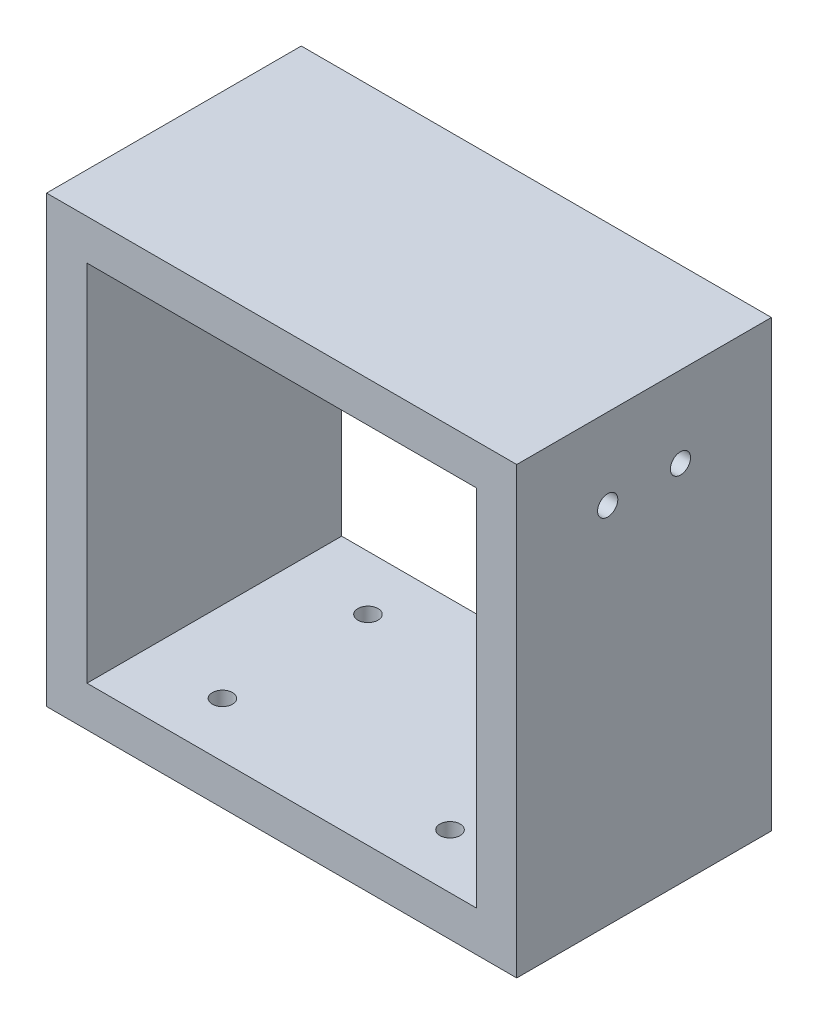
ISO-10303-21;
HEADER;
FILE_DESCRIPTION(('STEP AP214'),'2;1');
FILE_NAME('part.step','',(''),(''),'','','');
FILE_SCHEMA(('AUTOMOTIVE_DESIGN { 1 0 10303 214 1 1 1 1 }'));
ENDSEC;
DATA;
#1=APPLICATION_CONTEXT('core data for automotive mechanical design processes');
#2=APPLICATION_PROTOCOL_DEFINITION('international standard','automotive_design',2000,#1);
#3=PRODUCT_CONTEXT('',#1,'mechanical');
#4=PRODUCT('Part','Part','',(#3));
#5=PRODUCT_RELATED_PRODUCT_CATEGORY('part','',(#4));
#6=PRODUCT_DEFINITION_FORMATION('','',#4);
#7=PRODUCT_DEFINITION_CONTEXT('part definition',#1,'design');
#8=PRODUCT_DEFINITION('design','',#6,#7);
#9=PRODUCT_DEFINITION_SHAPE('','',#8);
#10=(LENGTH_UNIT() NAMED_UNIT(*) SI_UNIT(.MILLI.,.METRE.));
#11=(NAMED_UNIT(*) PLANE_ANGLE_UNIT() SI_UNIT($,.RADIAN.));
#12=(NAMED_UNIT(*) SI_UNIT($,.STERADIAN.) SOLID_ANGLE_UNIT());
#13=UNCERTAINTY_MEASURE_WITH_UNIT(LENGTH_MEASURE(1.E-05),#10,'distance_accuracy_value','');
#14=(GEOMETRIC_REPRESENTATION_CONTEXT(3) GLOBAL_UNCERTAINTY_ASSIGNED_CONTEXT((#13)) GLOBAL_UNIT_ASSIGNED_CONTEXT((#10,
#11,#12)) REPRESENTATION_CONTEXT('',''));
#15=CARTESIAN_POINT('',(0.,0.,0.));
#16=DIRECTION('',(0.,0.,1.));
#17=DIRECTION('',(1.,0.,0.));
#18=AXIS2_PLACEMENT_3D('',#15,#16,#17);
#19=CARTESIAN_POINT('',(0.,-55.,0.));
#20=DIRECTION('',(-1.,0.,0.));
#21=DIRECTION('',(0.,0.,1.));
#22=AXIS2_PLACEMENT_3D('',#19,#20,#21);
#23=PLANE('',#22);
#24=CARTESIAN_POINT('',(0.,-9.99999999999994,-11.25));
#25=DIRECTION('',(-1.,0.,0.));
#26=DIRECTION('',(0.,0.,1.));
#27=AXIS2_PLACEMENT_3D('',#24,#25,#26);
#28=CIRCLE('',#27,1.25);
#29=CARTESIAN_POINT('',(0.,-9.99999999999994,-10.));
#30=VERTEX_POINT('',#29);
#31=EDGE_CURVE('E238',#30,#30,#28,.T.);
#32=ORIENTED_EDGE('',*,*,#31,.F.);
#33=EDGE_LOOP('',(#32));
#34=FACE_BOUND('',#33,.T.);
#35=CARTESIAN_POINT('',(0.,-9.99999999999993,-20.25));
#36=DIRECTION('',(-1.,0.,0.));
#37=DIRECTION('',(0.,0.,1.));
#38=AXIS2_PLACEMENT_3D('',#35,#36,#37);
#39=CIRCLE('',#38,1.25);
#40=CARTESIAN_POINT('',(0.,-9.99999999999993,-19.));
#41=VERTEX_POINT('',#40);
#42=EDGE_CURVE('E231',#41,#41,#39,.T.);
#43=ORIENTED_EDGE('',*,*,#42,.F.);
#44=EDGE_LOOP('',(#43));
#45=FACE_BOUND('',#44,.T.);
#46=DIRECTION('',(0.,0.,1.));
#47=VECTOR('',#46,1.);
#48=CARTESIAN_POINT('',(0.,0.,0.));
#49=LINE('',#48,#47);
#50=CARTESIAN_POINT('',(0.,0.,-31.5));
#51=VERTEX_POINT('',#50);
#52=CARTESIAN_POINT('',(0.,0.,0.));
#53=VERTEX_POINT('',#52);
#54=EDGE_CURVE('E150',#51,#53,#49,.T.);
#55=ORIENTED_EDGE('',*,*,#54,.F.);
#56=DIRECTION('',(0.,1.,0.));
#57=VECTOR('',#56,1.);
#58=CARTESIAN_POINT('',(0.,-55.,-31.5));
#59=LINE('',#58,#57);
#60=CARTESIAN_POINT('',(0.,-55.,-31.5));
#61=VERTEX_POINT('',#60);
#62=EDGE_CURVE('E11',#61,#51,#59,.T.);
#63=ORIENTED_EDGE('',*,*,#62,.F.);
#64=DIRECTION('',(0.,0.,1.));
#65=VECTOR('',#64,1.);
#66=CARTESIAN_POINT('',(0.,-55.,0.));
#67=LINE('',#66,#65);
#68=CARTESIAN_POINT('',(0.,-55.,0.));
#69=VERTEX_POINT('',#68);
#70=EDGE_CURVE('E151',#61,#69,#67,.T.);
#71=ORIENTED_EDGE('',*,*,#70,.T.);
#72=DIRECTION('',(0.,1.,0.));
#73=VECTOR('',#72,1.);
#74=CARTESIAN_POINT('',(0.,-55.,0.));
#75=LINE('',#74,#73);
#76=EDGE_CURVE('E168',#69,#53,#75,.T.);
#77=ORIENTED_EDGE('',*,*,#76,.T.);
#78=EDGE_LOOP('',(#55,#63,#71,#77));
#79=FACE_BOUND('',#78,.T.);
#80=ADVANCED_FACE('F38',(#34,#45,#79),#23,.T.);
#81=CARTESIAN_POINT('',(0.,-55.,-31.5));
#82=DIRECTION('',(0.,0.,-1.));
#83=DIRECTION('',(-1.,0.,0.));
#84=AXIS2_PLACEMENT_3D('',#81,#82,#83);
#85=PLANE('',#84);
#86=DIRECTION('',(-1.,0.,0.));
#87=VECTOR('',#86,1.);
#88=CARTESIAN_POINT('',(4.99999999999999,-5.00000000000001,-31.5));
#89=LINE('',#88,#87);
#90=CARTESIAN_POINT('',(53.15,-5.,-31.5));
#91=VERTEX_POINT('',#90);
#92=CARTESIAN_POINT('',(4.99999999999999,-5.00000000000001,-31.5));
#93=VERTEX_POINT('',#92);
#94=EDGE_CURVE('E119',#91,#93,#89,.T.);
#95=ORIENTED_EDGE('',*,*,#94,.T.);
#96=DIRECTION('',(0.,-1.,0.));
#97=VECTOR('',#96,1.);
#98=CARTESIAN_POINT('',(5.,-50.,-31.5));
#99=LINE('',#98,#97);
#100=CARTESIAN_POINT('',(5.,-50.,-31.5));
#101=VERTEX_POINT('',#100);
#102=EDGE_CURVE('E105',#93,#101,#99,.T.);
#103=ORIENTED_EDGE('',*,*,#102,.T.);
#104=DIRECTION('',(1.,0.,0.));
#105=VECTOR('',#104,1.);
#106=CARTESIAN_POINT('',(5.,-50.,-31.5));
#107=LINE('',#106,#105);
#108=CARTESIAN_POINT('',(53.15,-50.,-31.5));
#109=VERTEX_POINT('',#108);
#110=EDGE_CURVE('E141',#101,#109,#107,.T.);
#111=ORIENTED_EDGE('',*,*,#110,.T.);
#112=DIRECTION('',(0.,1.,0.));
#113=VECTOR('',#112,1.);
#114=CARTESIAN_POINT('',(53.15,-50.,-31.5));
#115=LINE('',#114,#113);
#116=EDGE_CURVE('E128',#109,#91,#115,.T.);
#117=ORIENTED_EDGE('',*,*,#116,.T.);
#118=EDGE_LOOP('',(#95,#103,#111,#117));
#119=FACE_BOUND('',#118,.T.);
#120=DIRECTION('',(-1.,0.,0.));
#121=VECTOR('',#120,1.);
#122=CARTESIAN_POINT('',(0.,0.,-31.5));
#123=LINE('',#122,#121);
#124=CARTESIAN_POINT('',(58.15,0.,-31.5));
#125=VERTEX_POINT('',#124);
#126=EDGE_CURVE('E156',#125,#51,#123,.T.);
#127=ORIENTED_EDGE('',*,*,#126,.F.);
#128=DIRECTION('',(0.,1.,0.));
#129=VECTOR('',#128,1.);
#130=CARTESIAN_POINT('',(58.15,-55.,-31.5));
#131=LINE('',#130,#129);
#132=CARTESIAN_POINT('',(58.15,-55.,-31.5));
#133=VERTEX_POINT('',#132);
#134=EDGE_CURVE('E47',#133,#125,#131,.T.);
#135=ORIENTED_EDGE('',*,*,#134,.F.);
#136=DIRECTION('',(-1.,0.,0.));
#137=VECTOR('',#136,1.);
#138=CARTESIAN_POINT('',(0.,-55.,-31.5));
#139=LINE('',#138,#137);
#140=EDGE_CURVE('E164',#133,#61,#139,.T.);
#141=ORIENTED_EDGE('',*,*,#140,.T.);
#142=ORIENTED_EDGE('',*,*,#62,.T.);
#143=EDGE_LOOP('',(#127,#135,#141,#142));
#144=FACE_BOUND('',#143,.T.);
#145=ADVANCED_FACE('F126',(#119,#144),#85,.T.);
#146=CARTESIAN_POINT('',(58.15,-55.,0.));
#147=DIRECTION('',(1.,0.,0.));
#148=DIRECTION('',(0.,0.,-1.));
#149=AXIS2_PLACEMENT_3D('',#146,#147,#148);
#150=PLANE('',#149);
#151=CARTESIAN_POINT('',(58.15,-9.99999999999993,-20.25));
#152=DIRECTION('',(1.,0.,0.));
#153=DIRECTION('',(0.,0.,-1.));
#154=AXIS2_PLACEMENT_3D('',#151,#152,#153);
#155=CIRCLE('',#154,1.25);
#156=CARTESIAN_POINT('',(58.15,-9.99999999999993,-21.5));
#157=VERTEX_POINT('',#156);
#158=EDGE_CURVE('E211',#157,#157,#155,.T.);
#159=ORIENTED_EDGE('',*,*,#158,.F.);
#160=EDGE_LOOP('',(#159));
#161=FACE_BOUND('',#160,.T.);
#162=CARTESIAN_POINT('',(58.15,-9.99999999999993,-11.2499999999999));
#163=DIRECTION('',(1.,0.,0.));
#164=DIRECTION('',(0.,0.,-1.));
#165=AXIS2_PLACEMENT_3D('',#162,#163,#164);
#166=CIRCLE('',#165,1.25);
#167=CARTESIAN_POINT('',(58.15,-9.99999999999993,-12.4999999999999));
#168=VERTEX_POINT('',#167);
#169=EDGE_CURVE('E219',#168,#168,#166,.T.);
#170=ORIENTED_EDGE('',*,*,#169,.F.);
#171=EDGE_LOOP('',(#170));
#172=FACE_BOUND('',#171,.T.);
#173=DIRECTION('',(0.,0.,-1.));
#174=VECTOR('',#173,1.);
#175=CARTESIAN_POINT('',(58.15,0.,0.));
#176=LINE('',#175,#174);
#177=CARTESIAN_POINT('',(58.15,0.,0.));
#178=VERTEX_POINT('',#177);
#179=EDGE_CURVE('E176',#178,#125,#176,.T.);
#180=ORIENTED_EDGE('',*,*,#179,.F.);
#181=DIRECTION('',(0.,1.,0.));
#182=VECTOR('',#181,1.);
#183=CARTESIAN_POINT('',(58.15,-55.,0.));
#184=LINE('',#183,#182);
#185=CARTESIAN_POINT('',(58.15,-55.,0.));
#186=VERTEX_POINT('',#185);
#187=EDGE_CURVE('E185',#186,#178,#184,.T.);
#188=ORIENTED_EDGE('',*,*,#187,.F.);
#189=DIRECTION('',(0.,0.,-1.));
#190=VECTOR('',#189,1.);
#191=CARTESIAN_POINT('',(58.15,-55.,0.));
#192=LINE('',#191,#190);
#193=EDGE_CURVE('E160',#186,#133,#192,.T.);
#194=ORIENTED_EDGE('',*,*,#193,.T.);
#195=ORIENTED_EDGE('',*,*,#134,.T.);
#196=EDGE_LOOP('',(#180,#188,#194,#195));
#197=FACE_BOUND('',#196,.T.);
#198=ADVANCED_FACE('F265',(#161,#172,#197),#150,.T.);
#199=CARTESIAN_POINT('',(0.,-55.,0.));
#200=DIRECTION('',(0.,0.,1.));
#201=DIRECTION('',(1.,0.,0.));
#202=AXIS2_PLACEMENT_3D('',#199,#200,#201);
#203=PLANE('',#202);
#204=DIRECTION('',(-1.,0.,0.));
#205=VECTOR('',#204,1.);
#206=CARTESIAN_POINT('',(4.99999999999999,-5.00000000000001,0.));
#207=LINE('',#206,#205);
#208=CARTESIAN_POINT('',(53.15,-5.,0.));
#209=VERTEX_POINT('',#208);
#210=CARTESIAN_POINT('',(4.99999999999999,-5.00000000000001,0.));
#211=VERTEX_POINT('',#210);
#212=EDGE_CURVE('E122',#209,#211,#207,.T.);
#213=ORIENTED_EDGE('',*,*,#212,.F.);
#214=DIRECTION('',(0.,1.,0.));
#215=VECTOR('',#214,1.);
#216=CARTESIAN_POINT('',(53.15,-50.,0.));
#217=LINE('',#216,#215);
#218=CARTESIAN_POINT('',(53.15,-50.,0.));
#219=VERTEX_POINT('',#218);
#220=EDGE_CURVE('E136',#219,#209,#217,.T.);
#221=ORIENTED_EDGE('',*,*,#220,.F.);
#222=DIRECTION('',(1.,0.,0.));
#223=VECTOR('',#222,1.);
#224=CARTESIAN_POINT('',(5.,-50.,0.));
#225=LINE('',#224,#223);
#226=CARTESIAN_POINT('',(5.,-50.,0.));
#227=VERTEX_POINT('',#226);
#228=EDGE_CURVE('E63',#227,#219,#225,.T.);
#229=ORIENTED_EDGE('',*,*,#228,.F.);
#230=DIRECTION('',(0.,-1.,0.));
#231=VECTOR('',#230,1.);
#232=CARTESIAN_POINT('',(5.,-50.,0.));
#233=LINE('',#232,#231);
#234=EDGE_CURVE('E132',#211,#227,#233,.T.);
#235=ORIENTED_EDGE('',*,*,#234,.F.);
#236=EDGE_LOOP('',(#213,#221,#229,#235));
#237=FACE_BOUND('',#236,.T.);
#238=DIRECTION('',(1.,0.,0.));
#239=VECTOR('',#238,1.);
#240=CARTESIAN_POINT('',(0.,0.,0.));
#241=LINE('',#240,#239);
#242=EDGE_CURVE('E172',#53,#178,#241,.T.);
#243=ORIENTED_EDGE('',*,*,#242,.F.);
#244=ORIENTED_EDGE('',*,*,#76,.F.);
#245=DIRECTION('',(1.,0.,0.));
#246=VECTOR('',#245,1.);
#247=CARTESIAN_POINT('',(0.,-55.,0.));
#248=LINE('',#247,#246);
#249=EDGE_CURVE('E155',#69,#186,#248,.T.);
#250=ORIENTED_EDGE('',*,*,#249,.T.);
#251=ORIENTED_EDGE('',*,*,#187,.T.);
#252=EDGE_LOOP('',(#243,#244,#250,#251));
#253=FACE_BOUND('',#252,.T.);
#254=ADVANCED_FACE('F261',(#237,#253),#203,.T.);
#255=CARTESIAN_POINT('',(0.,-55.,0.));
#256=DIRECTION('',(0.,-1.,0.));
#257=DIRECTION('',(0.,0.,-1.));
#258=AXIS2_PLACEMENT_3D('',#255,#256,#257);
#259=PLANE('',#258);
#260=CARTESIAN_POINT('',(43.1500000000013,-55.,-24.7500000000079));
#261=DIRECTION('',(0.,-1.,0.));
#262=DIRECTION('',(0.,0.,-1.));
#263=AXIS2_PLACEMENT_3D('',#260,#261,#262);
#264=CIRCLE('',#263,1.25);
#265=CARTESIAN_POINT('',(43.1500000000013,-55.,-26.0000000000079));
#266=VERTEX_POINT('',#265);
#267=EDGE_CURVE('E204',#266,#266,#264,.T.);
#268=ORIENTED_EDGE('',*,*,#267,.F.);
#269=EDGE_LOOP('',(#268));
#270=FACE_BOUND('',#269,.T.);
#271=CARTESIAN_POINT('',(15.,-55.,-24.7500000000105));
#272=DIRECTION('',(0.,-1.,0.));
#273=DIRECTION('',(0.,0.,-1.));
#274=AXIS2_PLACEMENT_3D('',#271,#272,#273);
#275=CIRCLE('',#274,1.25);
#276=CARTESIAN_POINT('',(15.,-55.,-26.0000000000105));
#277=VERTEX_POINT('',#276);
#278=EDGE_CURVE('E242',#277,#277,#275,.T.);
#279=ORIENTED_EDGE('',*,*,#278,.F.);
#280=EDGE_LOOP('',(#279));
#281=FACE_BOUND('',#280,.T.);
#282=CARTESIAN_POINT('',(15.,-55.,-6.75000000001395));
#283=DIRECTION('',(0.,-1.,0.));
#284=DIRECTION('',(0.,0.,-1.));
#285=AXIS2_PLACEMENT_3D('',#282,#283,#284);
#286=CIRCLE('',#285,1.24999999999937);
#287=CARTESIAN_POINT('',(15.,-55.,-8.00000000001333));
#288=VERTEX_POINT('',#287);
#289=EDGE_CURVE('E195',#288,#288,#286,.T.);
#290=ORIENTED_EDGE('',*,*,#289,.F.);
#291=EDGE_LOOP('',(#290));
#292=FACE_BOUND('',#291,.T.);
#293=CARTESIAN_POINT('',(43.1499999999993,-55.,-6.75000000000007));
#294=DIRECTION('',(0.,-1.,0.));
#295=DIRECTION('',(0.,0.,-1.));
#296=AXIS2_PLACEMENT_3D('',#293,#294,#295);
#297=CIRCLE('',#296,1.25);
#298=CARTESIAN_POINT('',(43.1499999999993,-55.,-8.00000000000007));
#299=VERTEX_POINT('',#298);
#300=EDGE_CURVE('E207',#299,#299,#297,.T.);
#301=ORIENTED_EDGE('',*,*,#300,.F.);
#302=EDGE_LOOP('',(#301));
#303=FACE_BOUND('',#302,.T.);
#304=ORIENTED_EDGE('',*,*,#70,.F.);
#305=ORIENTED_EDGE('',*,*,#140,.F.);
#306=ORIENTED_EDGE('',*,*,#193,.F.);
#307=ORIENTED_EDGE('',*,*,#249,.F.);
#308=EDGE_LOOP('',(#304,#305,#306,#307));
#309=FACE_BOUND('',#308,.T.);
#310=ADVANCED_FACE('F264',(#270,#281,#292,#303,#309),#259,.T.);
#311=CARTESIAN_POINT('',(0.,0.,0.));
#312=DIRECTION('',(0.,-1.,0.));
#313=DIRECTION('',(0.,0.,-1.));
#314=AXIS2_PLACEMENT_3D('',#311,#312,#313);
#315=PLANE('',#314);
#316=ORIENTED_EDGE('',*,*,#54,.T.);
#317=ORIENTED_EDGE('',*,*,#242,.T.);
#318=ORIENTED_EDGE('',*,*,#179,.T.);
#319=ORIENTED_EDGE('',*,*,#126,.T.);
#320=EDGE_LOOP('',(#316,#317,#318,#319));
#321=FACE_BOUND('',#320,.T.);
#322=ADVANCED_FACE('F271',(#321),#315,.F.);
#323=CARTESIAN_POINT('',(4.99999999999999,-5.00000000000001,-97.4046470288704));
#324=DIRECTION('',(0.,1.,0.));
#325=DIRECTION('',(-1.,0.,0.));
#326=AXIS2_PLACEMENT_3D('',#323,#324,#325);
#327=PLANE('',#326);
#328=DIRECTION('',(0.,0.,1.));
#329=VECTOR('',#328,1.);
#330=CARTESIAN_POINT('',(53.15,-5.,-97.4046470288704));
#331=LINE('',#330,#329);
#332=EDGE_CURVE('E55',#91,#209,#331,.T.);
#333=ORIENTED_EDGE('',*,*,#332,.T.);
#334=ORIENTED_EDGE('',*,*,#212,.T.);
#335=DIRECTION('',(0.,0.,1.));
#336=VECTOR('',#335,1.);
#337=CARTESIAN_POINT('',(4.99999999999999,-5.00000000000001,-97.4046470288704));
#338=LINE('',#337,#336);
#339=EDGE_CURVE('E109',#93,#211,#338,.T.);
#340=ORIENTED_EDGE('',*,*,#339,.F.);
#341=ORIENTED_EDGE('',*,*,#94,.F.);
#342=EDGE_LOOP('',(#333,#334,#340,#341));
#343=FACE_BOUND('',#342,.T.);
#344=ADVANCED_FACE('F118',(#343),#327,.F.);
#345=CARTESIAN_POINT('',(5.,-50.,-97.4046470288704));
#346=DIRECTION('',(-1.,0.,0.));
#347=DIRECTION('',(0.,-1.,0.));
#348=AXIS2_PLACEMENT_3D('',#345,#346,#347);
#349=PLANE('',#348);
#350=CARTESIAN_POINT('',(4.99999999999999,-9.99999999999994,-11.25));
#351=DIRECTION('',(1.,0.,0.));
#352=DIRECTION('',(0.,1.,0.));
#353=AXIS2_PLACEMENT_3D('',#350,#351,#352);
#354=CIRCLE('',#353,1.25);
#355=CARTESIAN_POINT('',(4.99999999999999,-8.74999999999994,-11.25));
#356=VERTEX_POINT('',#355);
#357=EDGE_CURVE('E227',#356,#356,#354,.T.);
#358=ORIENTED_EDGE('',*,*,#357,.F.);
#359=EDGE_LOOP('',(#358));
#360=FACE_BOUND('',#359,.T.);
#361=CARTESIAN_POINT('',(4.99999999999999,-9.99999999999993,-20.25));
#362=DIRECTION('',(1.,0.,0.));
#363=DIRECTION('',(0.,1.,0.));
#364=AXIS2_PLACEMENT_3D('',#361,#362,#363);
#365=CIRCLE('',#364,1.25);
#366=CARTESIAN_POINT('',(4.99999999999999,-8.74999999999993,-20.25));
#367=VERTEX_POINT('',#366);
#368=EDGE_CURVE('E217',#367,#367,#365,.T.);
#369=ORIENTED_EDGE('',*,*,#368,.F.);
#370=EDGE_LOOP('',(#369));
#371=FACE_BOUND('',#370,.T.);
#372=ORIENTED_EDGE('',*,*,#339,.T.);
#373=ORIENTED_EDGE('',*,*,#234,.T.);
#374=DIRECTION('',(0.,0.,1.));
#375=VECTOR('',#374,1.);
#376=CARTESIAN_POINT('',(5.,-50.,-97.4046470288704));
#377=LINE('',#376,#375);
#378=EDGE_CURVE('E111',#101,#227,#377,.T.);
#379=ORIENTED_EDGE('',*,*,#378,.F.);
#380=ORIENTED_EDGE('',*,*,#102,.F.);
#381=EDGE_LOOP('',(#372,#373,#379,#380));
#382=FACE_BOUND('',#381,.T.);
#383=ADVANCED_FACE('F107',(#360,#371,#382),#349,.F.);
#384=CARTESIAN_POINT('',(5.,-50.,-97.4046470288704));
#385=DIRECTION('',(0.,-1.,0.));
#386=DIRECTION('',(1.,0.,0.));
#387=AXIS2_PLACEMENT_3D('',#384,#385,#386);
#388=PLANE('',#387);
#389=CARTESIAN_POINT('',(43.1500000000013,-50.,-24.7500000000079));
#390=DIRECTION('',(0.,-1.,0.));
#391=DIRECTION('',(1.,0.,0.));
#392=AXIS2_PLACEMENT_3D('',#389,#390,#391);
#393=CIRCLE('',#392,1.25);
#394=CARTESIAN_POINT('',(44.4000000000013,-50.,-24.7500000000079));
#395=VERTEX_POINT('',#394);
#396=EDGE_CURVE('E203',#395,#395,#393,.T.);
#397=ORIENTED_EDGE('',*,*,#396,.T.);
#398=EDGE_LOOP('',(#397));
#399=FACE_BOUND('',#398,.T.);
#400=CARTESIAN_POINT('',(15.,-50.,-24.7500000000105));
#401=DIRECTION('',(0.,-1.,0.));
#402=DIRECTION('',(1.,0.,0.));
#403=AXIS2_PLACEMENT_3D('',#400,#401,#402);
#404=CIRCLE('',#403,1.25);
#405=CARTESIAN_POINT('',(16.25,-50.,-24.7500000000105));
#406=VERTEX_POINT('',#405);
#407=EDGE_CURVE('E199',#406,#406,#404,.T.);
#408=ORIENTED_EDGE('',*,*,#407,.T.);
#409=EDGE_LOOP('',(#408));
#410=FACE_BOUND('',#409,.T.);
#411=CARTESIAN_POINT('',(15.,-50.,-6.75000000001395));
#412=DIRECTION('',(0.,-1.,0.));
#413=DIRECTION('',(1.,0.,0.));
#414=AXIS2_PLACEMENT_3D('',#411,#412,#413);
#415=CIRCLE('',#414,1.24999999999937);
#416=CARTESIAN_POINT('',(16.2499999999994,-50.,-6.75000000001395));
#417=VERTEX_POINT('',#416);
#418=EDGE_CURVE('E194',#417,#417,#415,.T.);
#419=ORIENTED_EDGE('',*,*,#418,.T.);
#420=EDGE_LOOP('',(#419));
#421=FACE_BOUND('',#420,.T.);
#422=CARTESIAN_POINT('',(43.1499999999993,-50.,-6.75000000000007));
#423=DIRECTION('',(0.,-1.,0.));
#424=DIRECTION('',(1.,0.,0.));
#425=AXIS2_PLACEMENT_3D('',#422,#423,#424);
#426=CIRCLE('',#425,1.25);
#427=CARTESIAN_POINT('',(44.3999999999993,-50.,-6.75000000000007));
#428=VERTEX_POINT('',#427);
#429=EDGE_CURVE('E190',#428,#428,#426,.T.);
#430=ORIENTED_EDGE('',*,*,#429,.T.);
#431=EDGE_LOOP('',(#430));
#432=FACE_BOUND('',#431,.T.);
#433=ORIENTED_EDGE('',*,*,#378,.T.);
#434=ORIENTED_EDGE('',*,*,#228,.T.);
#435=DIRECTION('',(0.,0.,1.));
#436=VECTOR('',#435,1.);
#437=CARTESIAN_POINT('',(53.15,-50.,-97.4046470288704));
#438=LINE('',#437,#436);
#439=EDGE_CURVE('E140',#109,#219,#438,.T.);
#440=ORIENTED_EDGE('',*,*,#439,.F.);
#441=ORIENTED_EDGE('',*,*,#110,.F.);
#442=EDGE_LOOP('',(#433,#434,#440,#441));
#443=FACE_BOUND('',#442,.T.);
#444=ADVANCED_FACE('F307',(#399,#410,#421,#432,#443),#388,.F.);
#445=CARTESIAN_POINT('',(53.15,-50.,-97.4046470288704));
#446=DIRECTION('',(1.,0.,0.));
#447=DIRECTION('',(0.,0.,-1.));
#448=AXIS2_PLACEMENT_3D('',#445,#446,#447);
#449=PLANE('',#448);
#450=CARTESIAN_POINT('',(53.15,-9.99999999999993,-20.25));
#451=DIRECTION('',(1.,0.,0.));
#452=DIRECTION('',(0.,0.,-1.));
#453=AXIS2_PLACEMENT_3D('',#450,#451,#452);
#454=CIRCLE('',#453,1.25);
#455=CARTESIAN_POINT('',(53.15,-9.99999999999993,-21.5));
#456=VERTEX_POINT('',#455);
#457=EDGE_CURVE('E41',#456,#456,#454,.T.);
#458=ORIENTED_EDGE('',*,*,#457,.T.);
#459=EDGE_LOOP('',(#458));
#460=FACE_BOUND('',#459,.T.);
#461=CARTESIAN_POINT('',(53.15,-9.99999999999993,-11.2499999999999));
#462=DIRECTION('',(1.,0.,0.));
#463=DIRECTION('',(0.,0.,-1.));
#464=AXIS2_PLACEMENT_3D('',#461,#462,#463);
#465=CIRCLE('',#464,1.25);
#466=CARTESIAN_POINT('',(53.15,-9.99999999999993,-12.4999999999999));
#467=VERTEX_POINT('',#466);
#468=EDGE_CURVE('E208',#467,#467,#465,.T.);
#469=ORIENTED_EDGE('',*,*,#468,.T.);
#470=EDGE_LOOP('',(#469));
#471=FACE_BOUND('',#470,.T.);
#472=ORIENTED_EDGE('',*,*,#439,.T.);
#473=ORIENTED_EDGE('',*,*,#220,.T.);
#474=ORIENTED_EDGE('',*,*,#332,.F.);
#475=ORIENTED_EDGE('',*,*,#116,.F.);
#476=EDGE_LOOP('',(#472,#473,#474,#475));
#477=FACE_BOUND('',#476,.T.);
#478=ADVANCED_FACE('F259',(#460,#471,#477),#449,.F.);
#479=CARTESIAN_POINT('',(43.1499999999993,-45.,-6.75000000000007));
#480=DIRECTION('',(0.,-1.,0.));
#481=DIRECTION('',(0.,0.,-1.));
#482=AXIS2_PLACEMENT_3D('',#479,#480,#481);
#483=CYLINDRICAL_SURFACE('',#482,1.25);
#484=ORIENTED_EDGE('',*,*,#300,.T.);
#485=EDGE_LOOP('',(#484));
#486=FACE_BOUND('',#485,.T.);
#487=ORIENTED_EDGE('',*,*,#429,.F.);
#488=EDGE_LOOP('',(#487));
#489=FACE_BOUND('',#488,.T.);
#490=ADVANCED_FACE('F351',(#486,#489),#483,.F.);
#491=CARTESIAN_POINT('',(15.,-45.,-6.75000000001395));
#492=DIRECTION('',(0.,-1.,0.));
#493=DIRECTION('',(0.,0.,-1.));
#494=AXIS2_PLACEMENT_3D('',#491,#492,#493);
#495=CYLINDRICAL_SURFACE('',#494,1.24999999999937);
#496=ORIENTED_EDGE('',*,*,#289,.T.);
#497=EDGE_LOOP('',(#496));
#498=FACE_BOUND('',#497,.T.);
#499=ORIENTED_EDGE('',*,*,#418,.F.);
#500=EDGE_LOOP('',(#499));
#501=FACE_BOUND('',#500,.T.);
#502=ADVANCED_FACE('F360',(#498,#501),#495,.F.);
#503=CARTESIAN_POINT('',(15.,-45.,-24.7500000000105));
#504=DIRECTION('',(0.,-1.,0.));
#505=DIRECTION('',(0.,0.,-1.));
#506=AXIS2_PLACEMENT_3D('',#503,#504,#505);
#507=CYLINDRICAL_SURFACE('',#506,1.25);
#508=ORIENTED_EDGE('',*,*,#278,.T.);
#509=EDGE_LOOP('',(#508));
#510=FACE_BOUND('',#509,.T.);
#511=ORIENTED_EDGE('',*,*,#407,.F.);
#512=EDGE_LOOP('',(#511));
#513=FACE_BOUND('',#512,.T.);
#514=ADVANCED_FACE('F367',(#510,#513),#507,.F.);
#515=CARTESIAN_POINT('',(43.1500000000013,-45.,-24.7500000000079));
#516=DIRECTION('',(0.,-1.,0.));
#517=DIRECTION('',(0.,0.,-1.));
#518=AXIS2_PLACEMENT_3D('',#515,#516,#517);
#519=CYLINDRICAL_SURFACE('',#518,1.25);
#520=ORIENTED_EDGE('',*,*,#267,.T.);
#521=EDGE_LOOP('',(#520));
#522=FACE_BOUND('',#521,.T.);
#523=ORIENTED_EDGE('',*,*,#396,.F.);
#524=EDGE_LOOP('',(#523));
#525=FACE_BOUND('',#524,.T.);
#526=ADVANCED_FACE('F303',(#522,#525),#519,.F.);
#527=CARTESIAN_POINT('',(-15.7,-9.99999999999994,-20.25));
#528=DIRECTION('',(1.,0.,0.));
#529=DIRECTION('',(0.,1.,0.));
#530=AXIS2_PLACEMENT_3D('',#527,#528,#529);
#531=CYLINDRICAL_SURFACE('',#530,1.25);
#532=ORIENTED_EDGE('',*,*,#42,.T.);
#533=EDGE_LOOP('',(#532));
#534=FACE_BOUND('',#533,.T.);
#535=ORIENTED_EDGE('',*,*,#368,.T.);
#536=EDGE_LOOP('',(#535));
#537=FACE_BOUND('',#536,.T.);
#538=ADVANCED_FACE('F299',(#534,#537),#531,.F.);
#539=CARTESIAN_POINT('',(-15.7,-9.99999999999994,-11.25));
#540=DIRECTION('',(1.,0.,0.));
#541=DIRECTION('',(0.,1.,0.));
#542=AXIS2_PLACEMENT_3D('',#539,#540,#541);
#543=CYLINDRICAL_SURFACE('',#542,1.25);
#544=ORIENTED_EDGE('',*,*,#31,.T.);
#545=EDGE_LOOP('',(#544));
#546=FACE_BOUND('',#545,.T.);
#547=ORIENTED_EDGE('',*,*,#357,.T.);
#548=EDGE_LOOP('',(#547));
#549=FACE_BOUND('',#548,.T.);
#550=ADVANCED_FACE('F302',(#546,#549),#543,.F.);
#551=CARTESIAN_POINT('',(37.45,-9.99999999999993,-11.2499999999999));
#552=DIRECTION('',(1.,0.,0.));
#553=DIRECTION('',(0.,0.,-1.));
#554=AXIS2_PLACEMENT_3D('',#551,#552,#553);
#555=CYLINDRICAL_SURFACE('',#554,1.25);
#556=ORIENTED_EDGE('',*,*,#169,.T.);
#557=EDGE_LOOP('',(#556));
#558=FACE_BOUND('',#557,.T.);
#559=ORIENTED_EDGE('',*,*,#468,.F.);
#560=EDGE_LOOP('',(#559));
#561=FACE_BOUND('',#560,.T.);
#562=ADVANCED_FACE('F389',(#558,#561),#555,.F.);
#563=CARTESIAN_POINT('',(37.45,-9.99999999999993,-20.25));
#564=DIRECTION('',(1.,0.,0.));
#565=DIRECTION('',(0.,0.,-1.));
#566=AXIS2_PLACEMENT_3D('',#563,#564,#565);
#567=CYLINDRICAL_SURFACE('',#566,1.25);
#568=ORIENTED_EDGE('',*,*,#158,.T.);
#569=EDGE_LOOP('',(#568));
#570=FACE_BOUND('',#569,.T.);
#571=ORIENTED_EDGE('',*,*,#457,.F.);
#572=EDGE_LOOP('',(#571));
#573=FACE_BOUND('',#572,.T.);
#574=ADVANCED_FACE('F396',(#570,#573),#567,.F.);
#575=CLOSED_SHELL('',(#80,#145,#198,#254,#310,#322,#344,#383,#444,#478,#490,#502,#514,#526,#538,
#550,#562,#574));
#576=MANIFOLD_SOLID_BREP('B2',#575);
#577=ADVANCED_BREP_SHAPE_REPRESENTATION('',(#18,#576),#14);
#578=SHAPE_DEFINITION_REPRESENTATION(#9,#577);
ENDSEC;
END-ISO-10303-21;
